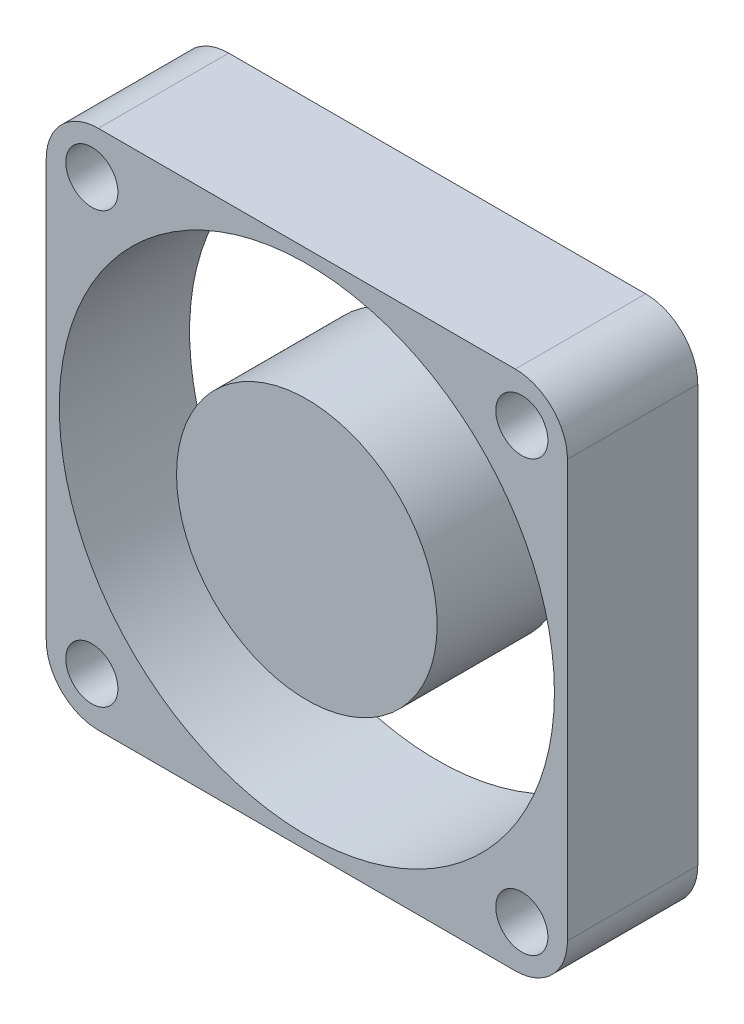
ISO-10303-21;
HEADER;
FILE_DESCRIPTION(('STEP AP214'),'2;1');
FILE_NAME('part.step','',(''),(''),'','','');
FILE_SCHEMA(('AUTOMOTIVE_DESIGN { 1 0 10303 214 1 1 1 1 }'));
ENDSEC;
DATA;
#1=APPLICATION_CONTEXT('core data for automotive mechanical design processes');
#2=APPLICATION_PROTOCOL_DEFINITION('international standard','automotive_design',2000,#1);
#3=PRODUCT_CONTEXT('',#1,'mechanical');
#4=PRODUCT('Part','Part','',(#3));
#5=PRODUCT_RELATED_PRODUCT_CATEGORY('part','',(#4));
#6=PRODUCT_DEFINITION_FORMATION('','',#4);
#7=PRODUCT_DEFINITION_CONTEXT('part definition',#1,'design');
#8=PRODUCT_DEFINITION('design','',#6,#7);
#9=PRODUCT_DEFINITION_SHAPE('','',#8);
#10=(LENGTH_UNIT() NAMED_UNIT(*) SI_UNIT(.MILLI.,.METRE.));
#11=(NAMED_UNIT(*) PLANE_ANGLE_UNIT() SI_UNIT($,.RADIAN.));
#12=(NAMED_UNIT(*) SI_UNIT($,.STERADIAN.) SOLID_ANGLE_UNIT());
#13=UNCERTAINTY_MEASURE_WITH_UNIT(LENGTH_MEASURE(1.E-05),#10,'distance_accuracy_value','');
#14=(GEOMETRIC_REPRESENTATION_CONTEXT(3) GLOBAL_UNCERTAINTY_ASSIGNED_CONTEXT((#13)) GLOBAL_UNIT_ASSIGNED_CONTEXT((#10,
#11,#12)) REPRESENTATION_CONTEXT('',''));
#15=CARTESIAN_POINT('',(0.,0.,0.));
#16=DIRECTION('',(0.,0.,1.));
#17=DIRECTION('',(1.,0.,0.));
#18=AXIS2_PLACEMENT_3D('',#15,#16,#17);
#19=CARTESIAN_POINT('',(20.,20.,10.));
#20=DIRECTION('',(0.,0.,-1.));
#21=DIRECTION('',(-1.,0.,0.));
#22=AXIS2_PLACEMENT_3D('',#19,#20,#21);
#23=CYLINDRICAL_SURFACE('',#22,10.);
#24=CARTESIAN_POINT('',(20.,20.,10.));
#25=DIRECTION('',(0.,0.,1.));
#26=DIRECTION('',(1.,0.,0.));
#27=AXIS2_PLACEMENT_3D('',#24,#25,#26);
#28=CIRCLE('',#27,10.);
#29=CARTESIAN_POINT('',(30.,20.,10.));
#30=VERTEX_POINT('',#29);
#31=EDGE_CURVE('E12',#30,#30,#28,.T.);
#32=ORIENTED_EDGE('',*,*,#31,.F.);
#33=EDGE_LOOP('',(#32));
#34=FACE_BOUND('',#33,.T.);
#35=CARTESIAN_POINT('',(20.,20.,0.));
#36=DIRECTION('',(0.,0.,1.));
#37=DIRECTION('',(1.,0.,0.));
#38=AXIS2_PLACEMENT_3D('',#35,#36,#37);
#39=CIRCLE('',#38,10.);
#40=CARTESIAN_POINT('',(30.,20.,0.));
#41=VERTEX_POINT('',#40);
#42=EDGE_CURVE('E60',#41,#41,#39,.T.);
#43=ORIENTED_EDGE('',*,*,#42,.T.);
#44=EDGE_LOOP('',(#43));
#45=FACE_BOUND('',#44,.T.);
#46=ADVANCED_FACE('F57',(#34,#45),#23,.T.);
#47=CARTESIAN_POINT('',(20.,-24.1414213562373,10.));
#48=DIRECTION('',(0.,0.,1.));
#49=DIRECTION('',(1.,0.,0.));
#50=AXIS2_PLACEMENT_3D('',#47,#48,#49);
#51=PLANE('',#50);
#52=ORIENTED_EDGE('',*,*,#31,.T.);
#53=EDGE_LOOP('',(#52));
#54=FACE_BOUND('',#53,.T.);
#55=ADVANCED_FACE('F72',(#54),#51,.T.);
#56=CARTESIAN_POINT('',(20.,-24.1414213562373,0.));
#57=DIRECTION('',(0.,0.,1.));
#58=DIRECTION('',(1.,0.,0.));
#59=AXIS2_PLACEMENT_3D('',#56,#57,#58);
#60=PLANE('',#59);
#61=ORIENTED_EDGE('',*,*,#42,.F.);
#62=EDGE_LOOP('',(#61));
#63=FACE_BOUND('',#62,.T.);
#64=ADVANCED_FACE('F70',(#63),#60,.F.);
#65=CLOSED_SHELL('',(#46,#55,#64));
#66=MANIFOLD_SOLID_BREP('B2',#65);
#67=CARTESIAN_POINT('',(20.,0.,10.));
#68=DIRECTION('',(0.,1.,0.));
#69=DIRECTION('',(0.,0.,1.));
#70=AXIS2_PLACEMENT_3D('',#67,#68,#69);
#71=PLANE('',#70);
#72=DIRECTION('',(1.,0.,0.));
#73=VECTOR('',#72,1.);
#74=CARTESIAN_POINT('',(20.,0.,10.));
#75=LINE('',#74,#73);
#76=CARTESIAN_POINT('',(4.,0.,10.));
#77=VERTEX_POINT('',#76);
#78=CARTESIAN_POINT('',(36.,0.,10.));
#79=VERTEX_POINT('',#78);
#80=EDGE_CURVE('E220',#77,#79,#75,.T.);
#81=ORIENTED_EDGE('',*,*,#80,.F.);
#82=DIRECTION('',(0.,0.,-1.));
#83=VECTOR('',#82,1.);
#84=CARTESIAN_POINT('',(4.,0.,0.));
#85=LINE('',#84,#83);
#86=CARTESIAN_POINT('',(4.,0.,0.));
#87=VERTEX_POINT('',#86);
#88=EDGE_CURVE('E216',#77,#87,#85,.T.);
#89=ORIENTED_EDGE('',*,*,#88,.T.);
#90=DIRECTION('',(1.,0.,0.));
#91=VECTOR('',#90,1.);
#92=CARTESIAN_POINT('',(20.,0.,0.));
#93=LINE('',#92,#91);
#94=CARTESIAN_POINT('',(36.,0.,0.));
#95=VERTEX_POINT('',#94);
#96=EDGE_CURVE('E170',#87,#95,#93,.T.);
#97=ORIENTED_EDGE('',*,*,#96,.T.);
#98=DIRECTION('',(0.,0.,-1.));
#99=VECTOR('',#98,1.);
#100=CARTESIAN_POINT('',(36.,0.,10.));
#101=LINE('',#100,#99);
#102=EDGE_CURVE('E214',#95,#79,#101,.F.);
#103=ORIENTED_EDGE('',*,*,#102,.T.);
#104=EDGE_LOOP('',(#81,#89,#97,#103));
#105=FACE_BOUND('',#104,.T.);
#106=ADVANCED_FACE('F99',(#105),#71,.F.);
#107=CARTESIAN_POINT('',(40.,-24.1414213562373,10.));
#108=DIRECTION('',(-1.,0.,0.));
#109=DIRECTION('',(0.,-1.,0.));
#110=AXIS2_PLACEMENT_3D('',#107,#108,#109);
#111=PLANE('',#110);
#112=DIRECTION('',(0.,1.,0.));
#113=VECTOR('',#112,1.);
#114=CARTESIAN_POINT('',(40.,-24.1414213562373,10.));
#115=LINE('',#114,#113);
#116=CARTESIAN_POINT('',(40.,4.,10.));
#117=VERTEX_POINT('',#116);
#118=CARTESIAN_POINT('',(40.,36.,10.));
#119=VERTEX_POINT('',#118);
#120=EDGE_CURVE('E221',#117,#119,#115,.T.);
#121=ORIENTED_EDGE('',*,*,#120,.F.);
#122=DIRECTION('',(0.,0.,-1.));
#123=VECTOR('',#122,1.);
#124=CARTESIAN_POINT('',(40.,4.,10.));
#125=LINE('',#124,#123);
#126=CARTESIAN_POINT('',(40.,4.,0.));
#127=VERTEX_POINT('',#126);
#128=EDGE_CURVE('E55',#117,#127,#125,.T.);
#129=ORIENTED_EDGE('',*,*,#128,.T.);
#130=DIRECTION('',(0.,1.,0.));
#131=VECTOR('',#130,1.);
#132=CARTESIAN_POINT('',(40.,-24.1414213562373,0.));
#133=LINE('',#132,#131);
#134=CARTESIAN_POINT('',(40.,36.,0.));
#135=VERTEX_POINT('',#134);
#136=EDGE_CURVE('E248',#127,#135,#133,.T.);
#137=ORIENTED_EDGE('',*,*,#136,.T.);
#138=DIRECTION('',(0.,0.,-1.));
#139=VECTOR('',#138,1.);
#140=CARTESIAN_POINT('',(40.,36.,10.));
#141=LINE('',#140,#139);
#142=EDGE_CURVE('E107',#135,#119,#141,.F.);
#143=ORIENTED_EDGE('',*,*,#142,.T.);
#144=EDGE_LOOP('',(#121,#129,#137,#143));
#145=FACE_BOUND('',#144,.T.);
#146=ADVANCED_FACE('F270',(#145),#111,.F.);
#147=CARTESIAN_POINT('',(20.,40.,10.));
#148=DIRECTION('',(0.,1.,0.));
#149=DIRECTION('',(0.,0.,1.));
#150=AXIS2_PLACEMENT_3D('',#147,#148,#149);
#151=PLANE('',#150);
#152=DIRECTION('',(1.,0.,0.));
#153=VECTOR('',#152,1.);
#154=CARTESIAN_POINT('',(20.,40.,0.));
#155=LINE('',#154,#153);
#156=CARTESIAN_POINT('',(4.,40.,0.));
#157=VERTEX_POINT('',#156);
#158=CARTESIAN_POINT('',(36.,40.,0.));
#159=VERTEX_POINT('',#158);
#160=EDGE_CURVE('E187',#157,#159,#155,.T.);
#161=ORIENTED_EDGE('',*,*,#160,.F.);
#162=DIRECTION('',(0.,0.,-1.));
#163=VECTOR('',#162,1.);
#164=CARTESIAN_POINT('',(4.,40.,10.));
#165=LINE('',#164,#163);
#166=CARTESIAN_POINT('',(4.,40.,10.));
#167=VERTEX_POINT('',#166);
#168=EDGE_CURVE('E206',#157,#167,#165,.F.);
#169=ORIENTED_EDGE('',*,*,#168,.T.);
#170=DIRECTION('',(1.,0.,0.));
#171=VECTOR('',#170,1.);
#172=CARTESIAN_POINT('',(20.,40.,10.));
#173=LINE('',#172,#171);
#174=CARTESIAN_POINT('',(36.,40.,10.));
#175=VERTEX_POINT('',#174);
#176=EDGE_CURVE('E196',#167,#175,#173,.T.);
#177=ORIENTED_EDGE('',*,*,#176,.T.);
#178=DIRECTION('',(0.,0.,-1.));
#179=VECTOR('',#178,1.);
#180=CARTESIAN_POINT('',(36.,40.,0.));
#181=LINE('',#180,#179);
#182=EDGE_CURVE('E203',#175,#159,#181,.T.);
#183=ORIENTED_EDGE('',*,*,#182,.T.);
#184=EDGE_LOOP('',(#161,#169,#177,#183));
#185=FACE_BOUND('',#184,.T.);
#186=ADVANCED_FACE('F254',(#185),#151,.T.);
#187=CARTESIAN_POINT('',(20.,20.,10.));
#188=DIRECTION('',(0.,0.,-1.));
#189=DIRECTION('',(-1.,0.,0.));
#190=AXIS2_PLACEMENT_3D('',#187,#188,#189);
#191=CYLINDRICAL_SURFACE('',#190,19.);
#192=CARTESIAN_POINT('',(20.,20.,10.));
#193=DIRECTION('',(0.,0.,1.));
#194=DIRECTION('',(1.,0.,0.));
#195=AXIS2_PLACEMENT_3D('',#192,#193,#194);
#196=CIRCLE('',#195,19.);
#197=CARTESIAN_POINT('',(39.,20.,10.));
#198=VERTEX_POINT('',#197);
#199=EDGE_CURVE('E222',#198,#198,#196,.T.);
#200=ORIENTED_EDGE('',*,*,#199,.T.);
#201=EDGE_LOOP('',(#200));
#202=FACE_BOUND('',#201,.T.);
#203=CARTESIAN_POINT('',(20.,20.,0.));
#204=DIRECTION('',(0.,0.,1.));
#205=DIRECTION('',(1.,0.,0.));
#206=AXIS2_PLACEMENT_3D('',#203,#204,#205);
#207=CIRCLE('',#206,19.);
#208=CARTESIAN_POINT('',(39.,20.,0.));
#209=VERTEX_POINT('',#208);
#210=EDGE_CURVE('E244',#209,#209,#207,.T.);
#211=ORIENTED_EDGE('',*,*,#210,.F.);
#212=EDGE_LOOP('',(#211));
#213=FACE_BOUND('',#212,.T.);
#214=ADVANCED_FACE('F278',(#202,#213),#191,.F.);
#215=CARTESIAN_POINT('',(36.5,36.5,10.));
#216=DIRECTION('',(0.,0.,-1.));
#217=DIRECTION('',(-1.,0.,0.));
#218=AXIS2_PLACEMENT_3D('',#215,#216,#217);
#219=CYLINDRICAL_SURFACE('',#218,2.);
#220=CARTESIAN_POINT('',(36.5,36.5,10.));
#221=DIRECTION('',(0.,0.,1.));
#222=DIRECTION('',(1.,0.,0.));
#223=AXIS2_PLACEMENT_3D('',#220,#221,#222);
#224=CIRCLE('',#223,2.);
#225=CARTESIAN_POINT('',(38.5,36.5,10.));
#226=VERTEX_POINT('',#225);
#227=EDGE_CURVE('E226',#226,#226,#224,.T.);
#228=ORIENTED_EDGE('',*,*,#227,.T.);
#229=EDGE_LOOP('',(#228));
#230=FACE_BOUND('',#229,.T.);
#231=CARTESIAN_POINT('',(36.5,36.5,0.));
#232=DIRECTION('',(0.,0.,1.));
#233=DIRECTION('',(1.,0.,0.));
#234=AXIS2_PLACEMENT_3D('',#231,#232,#233);
#235=CIRCLE('',#234,2.);
#236=CARTESIAN_POINT('',(38.5,36.5,0.));
#237=VERTEX_POINT('',#236);
#238=EDGE_CURVE('E241',#237,#237,#235,.T.);
#239=ORIENTED_EDGE('',*,*,#238,.F.);
#240=EDGE_LOOP('',(#239));
#241=FACE_BOUND('',#240,.T.);
#242=ADVANCED_FACE('F281',(#230,#241),#219,.F.);
#243=CARTESIAN_POINT('',(36.5,3.5,10.));
#244=DIRECTION('',(0.,0.,-1.));
#245=DIRECTION('',(-1.,0.,0.));
#246=AXIS2_PLACEMENT_3D('',#243,#244,#245);
#247=CYLINDRICAL_SURFACE('',#246,2.);
#248=CARTESIAN_POINT('',(36.5,3.5,10.));
#249=DIRECTION('',(0.,0.,1.));
#250=DIRECTION('',(1.,0.,0.));
#251=AXIS2_PLACEMENT_3D('',#248,#249,#250);
#252=CIRCLE('',#251,2.);
#253=CARTESIAN_POINT('',(38.5,3.5,10.));
#254=VERTEX_POINT('',#253);
#255=EDGE_CURVE('E406',#254,#254,#252,.T.);
#256=ORIENTED_EDGE('',*,*,#255,.T.);
#257=EDGE_LOOP('',(#256));
#258=FACE_BOUND('',#257,.T.);
#259=CARTESIAN_POINT('',(36.5,3.5,0.));
#260=DIRECTION('',(0.,0.,1.));
#261=DIRECTION('',(1.,0.,0.));
#262=AXIS2_PLACEMENT_3D('',#259,#260,#261);
#263=CIRCLE('',#262,2.);
#264=CARTESIAN_POINT('',(38.5,3.5,0.));
#265=VERTEX_POINT('',#264);
#266=EDGE_CURVE('E238',#265,#265,#263,.T.);
#267=ORIENTED_EDGE('',*,*,#266,.F.);
#268=EDGE_LOOP('',(#267));
#269=FACE_BOUND('',#268,.T.);
#270=ADVANCED_FACE('F285',(#258,#269),#247,.F.);
#271=CARTESIAN_POINT('',(3.5,3.5,10.));
#272=DIRECTION('',(0.,0.,-1.));
#273=DIRECTION('',(-1.,0.,0.));
#274=AXIS2_PLACEMENT_3D('',#271,#272,#273);
#275=CYLINDRICAL_SURFACE('',#274,2.);
#276=CARTESIAN_POINT('',(3.5,3.5,10.));
#277=DIRECTION('',(0.,0.,1.));
#278=DIRECTION('',(1.,0.,0.));
#279=AXIS2_PLACEMENT_3D('',#276,#277,#278);
#280=CIRCLE('',#279,2.);
#281=CARTESIAN_POINT('',(5.5,3.5,10.));
#282=VERTEX_POINT('',#281);
#283=EDGE_CURVE('E402',#282,#282,#280,.T.);
#284=ORIENTED_EDGE('',*,*,#283,.T.);
#285=EDGE_LOOP('',(#284));
#286=FACE_BOUND('',#285,.T.);
#287=CARTESIAN_POINT('',(3.5,3.5,0.));
#288=DIRECTION('',(0.,0.,1.));
#289=DIRECTION('',(1.,0.,0.));
#290=AXIS2_PLACEMENT_3D('',#287,#288,#289);
#291=CIRCLE('',#290,2.);
#292=CARTESIAN_POINT('',(5.5,3.5,0.));
#293=VERTEX_POINT('',#292);
#294=EDGE_CURVE('E235',#293,#293,#291,.T.);
#295=ORIENTED_EDGE('',*,*,#294,.F.);
#296=EDGE_LOOP('',(#295));
#297=FACE_BOUND('',#296,.T.);
#298=ADVANCED_FACE('F289',(#286,#297),#275,.F.);
#299=CARTESIAN_POINT('',(3.5,36.5,10.));
#300=DIRECTION('',(0.,0.,-1.));
#301=DIRECTION('',(-1.,0.,0.));
#302=AXIS2_PLACEMENT_3D('',#299,#300,#301);
#303=CYLINDRICAL_SURFACE('',#302,2.);
#304=CARTESIAN_POINT('',(3.5,36.5,10.));
#305=DIRECTION('',(0.,0.,1.));
#306=DIRECTION('',(1.,0.,0.));
#307=AXIS2_PLACEMENT_3D('',#304,#305,#306);
#308=CIRCLE('',#307,2.);
#309=CARTESIAN_POINT('',(5.5,36.5,10.));
#310=VERTEX_POINT('',#309);
#311=EDGE_CURVE('E186',#310,#310,#308,.T.);
#312=ORIENTED_EDGE('',*,*,#311,.T.);
#313=EDGE_LOOP('',(#312));
#314=FACE_BOUND('',#313,.T.);
#315=CARTESIAN_POINT('',(3.5,36.5,0.));
#316=DIRECTION('',(0.,0.,1.));
#317=DIRECTION('',(1.,0.,0.));
#318=AXIS2_PLACEMENT_3D('',#315,#316,#317);
#319=CIRCLE('',#318,2.);
#320=CARTESIAN_POINT('',(5.5,36.5,0.));
#321=VERTEX_POINT('',#320);
#322=EDGE_CURVE('E232',#321,#321,#319,.T.);
#323=ORIENTED_EDGE('',*,*,#322,.F.);
#324=EDGE_LOOP('',(#323));
#325=FACE_BOUND('',#324,.T.);
#326=ADVANCED_FACE('F293',(#314,#325),#303,.F.);
#327=CARTESIAN_POINT('',(0.,-24.1414213562373,10.));
#328=DIRECTION('',(-1.,0.,0.));
#329=DIRECTION('',(0.,0.,1.));
#330=AXIS2_PLACEMENT_3D('',#327,#328,#329);
#331=PLANE('',#330);
#332=DIRECTION('',(0.,1.,0.));
#333=VECTOR('',#332,1.);
#334=CARTESIAN_POINT('',(0.,-24.1414213562373,10.));
#335=LINE('',#334,#333);
#336=CARTESIAN_POINT('',(0.,4.,10.));
#337=VERTEX_POINT('',#336);
#338=CARTESIAN_POINT('',(0.,36.,10.));
#339=VERTEX_POINT('',#338);
#340=EDGE_CURVE('E192',#337,#339,#335,.T.);
#341=ORIENTED_EDGE('',*,*,#340,.T.);
#342=DIRECTION('',(0.,0.,-1.));
#343=VECTOR('',#342,1.);
#344=CARTESIAN_POINT('',(0.,36.,10.));
#345=LINE('',#344,#343);
#346=CARTESIAN_POINT('',(0.,36.,0.));
#347=VERTEX_POINT('',#346);
#348=EDGE_CURVE('E185',#339,#347,#345,.T.);
#349=ORIENTED_EDGE('',*,*,#348,.T.);
#350=DIRECTION('',(0.,1.,0.));
#351=VECTOR('',#350,1.);
#352=CARTESIAN_POINT('',(0.,-24.1414213562373,0.));
#353=LINE('',#352,#351);
#354=CARTESIAN_POINT('',(0.,4.,0.));
#355=VERTEX_POINT('',#354);
#356=EDGE_CURVE('E168',#355,#347,#353,.T.);
#357=ORIENTED_EDGE('',*,*,#356,.F.);
#358=DIRECTION('',(0.,0.,-1.));
#359=VECTOR('',#358,1.);
#360=CARTESIAN_POINT('',(0.,4.,10.));
#361=LINE('',#360,#359);
#362=EDGE_CURVE('E182',#355,#337,#361,.F.);
#363=ORIENTED_EDGE('',*,*,#362,.T.);
#364=EDGE_LOOP('',(#341,#349,#357,#363));
#365=FACE_BOUND('',#364,.T.);
#366=ADVANCED_FACE('F181',(#365),#331,.T.);
#367=CARTESIAN_POINT('',(20.,-24.1414213562373,10.));
#368=DIRECTION('',(0.,0.,1.));
#369=DIRECTION('',(1.,0.,0.));
#370=AXIS2_PLACEMENT_3D('',#367,#368,#369);
#371=PLANE('',#370);
#372=ORIENTED_EDGE('',*,*,#311,.F.);
#373=EDGE_LOOP('',(#372));
#374=FACE_BOUND('',#373,.T.);
#375=ORIENTED_EDGE('',*,*,#283,.F.);
#376=EDGE_LOOP('',(#375));
#377=FACE_BOUND('',#376,.T.);
#378=ORIENTED_EDGE('',*,*,#255,.F.);
#379=EDGE_LOOP('',(#378));
#380=FACE_BOUND('',#379,.T.);
#381=ORIENTED_EDGE('',*,*,#227,.F.);
#382=EDGE_LOOP('',(#381));
#383=FACE_BOUND('',#382,.T.);
#384=ORIENTED_EDGE('',*,*,#199,.F.);
#385=EDGE_LOOP('',(#384));
#386=FACE_BOUND('',#385,.T.);
#387=ORIENTED_EDGE('',*,*,#176,.F.);
#388=CARTESIAN_POINT('',(4.,36.,10.));
#389=DIRECTION('',(0.,0.,1.));
#390=DIRECTION('',(1.,0.,0.));
#391=AXIS2_PLACEMENT_3D('',#388,#389,#390);
#392=CIRCLE('',#391,4.);
#393=EDGE_CURVE('E212',#167,#339,#392,.T.);
#394=ORIENTED_EDGE('',*,*,#393,.T.);
#395=ORIENTED_EDGE('',*,*,#340,.F.);
#396=CARTESIAN_POINT('',(4.,4.,10.));
#397=DIRECTION('',(0.,0.,1.));
#398=DIRECTION('',(1.,0.,0.));
#399=AXIS2_PLACEMENT_3D('',#396,#397,#398);
#400=CIRCLE('',#399,4.);
#401=EDGE_CURVE('E191',#337,#77,#400,.T.);
#402=ORIENTED_EDGE('',*,*,#401,.T.);
#403=ORIENTED_EDGE('',*,*,#80,.T.);
#404=CARTESIAN_POINT('',(36.,4.,10.));
#405=DIRECTION('',(0.,0.,1.));
#406=DIRECTION('',(1.,0.,0.));
#407=AXIS2_PLACEMENT_3D('',#404,#405,#406);
#408=CIRCLE('',#407,4.);
#409=EDGE_CURVE('E120',#79,#117,#408,.T.);
#410=ORIENTED_EDGE('',*,*,#409,.T.);
#411=ORIENTED_EDGE('',*,*,#120,.T.);
#412=CARTESIAN_POINT('',(36.,36.,10.));
#413=DIRECTION('',(0.,0.,1.));
#414=DIRECTION('',(1.,0.,0.));
#415=AXIS2_PLACEMENT_3D('',#412,#413,#414);
#416=CIRCLE('',#415,4.);
#417=EDGE_CURVE('E208',#119,#175,#416,.T.);
#418=ORIENTED_EDGE('',*,*,#417,.T.);
#419=EDGE_LOOP('',(#387,#394,#395,#402,#403,#410,#411,#418));
#420=FACE_BOUND('',#419,.T.);
#421=ADVANCED_FACE('F260',(#374,#377,#380,#383,#386,#420),#371,.T.);
#422=CARTESIAN_POINT('',(20.,-24.1414213562373,0.));
#423=DIRECTION('',(0.,0.,1.));
#424=DIRECTION('',(1.,0.,0.));
#425=AXIS2_PLACEMENT_3D('',#422,#423,#424);
#426=PLANE('',#425);
#427=ORIENTED_EDGE('',*,*,#322,.T.);
#428=EDGE_LOOP('',(#427));
#429=FACE_BOUND('',#428,.T.);
#430=ORIENTED_EDGE('',*,*,#294,.T.);
#431=EDGE_LOOP('',(#430));
#432=FACE_BOUND('',#431,.T.);
#433=ORIENTED_EDGE('',*,*,#266,.T.);
#434=EDGE_LOOP('',(#433));
#435=FACE_BOUND('',#434,.T.);
#436=ORIENTED_EDGE('',*,*,#238,.T.);
#437=EDGE_LOOP('',(#436));
#438=FACE_BOUND('',#437,.T.);
#439=ORIENTED_EDGE('',*,*,#210,.T.);
#440=EDGE_LOOP('',(#439));
#441=FACE_BOUND('',#440,.T.);
#442=ORIENTED_EDGE('',*,*,#356,.T.);
#443=CARTESIAN_POINT('',(4.,36.,0.));
#444=DIRECTION('',(0.,0.,1.));
#445=DIRECTION('',(1.,0.,0.));
#446=AXIS2_PLACEMENT_3D('',#443,#444,#445);
#447=CIRCLE('',#446,4.);
#448=EDGE_CURVE('E175',#347,#157,#447,.F.);
#449=ORIENTED_EDGE('',*,*,#448,.T.);
#450=ORIENTED_EDGE('',*,*,#160,.T.);
#451=CARTESIAN_POINT('',(36.,36.,0.));
#452=DIRECTION('',(0.,0.,1.));
#453=DIRECTION('',(1.,0.,0.));
#454=AXIS2_PLACEMENT_3D('',#451,#452,#453);
#455=CIRCLE('',#454,4.);
#456=EDGE_CURVE('E194',#159,#135,#455,.F.);
#457=ORIENTED_EDGE('',*,*,#456,.T.);
#458=ORIENTED_EDGE('',*,*,#136,.F.);
#459=CARTESIAN_POINT('',(36.,4.,0.));
#460=DIRECTION('',(0.,0.,1.));
#461=DIRECTION('',(1.,0.,0.));
#462=AXIS2_PLACEMENT_3D('',#459,#460,#461);
#463=CIRCLE('',#462,4.);
#464=EDGE_CURVE('E176',#127,#95,#463,.F.);
#465=ORIENTED_EDGE('',*,*,#464,.T.);
#466=ORIENTED_EDGE('',*,*,#96,.F.);
#467=CARTESIAN_POINT('',(4.,4.,0.));
#468=DIRECTION('',(0.,0.,1.));
#469=DIRECTION('',(1.,0.,0.));
#470=AXIS2_PLACEMENT_3D('',#467,#468,#469);
#471=CIRCLE('',#470,4.);
#472=EDGE_CURVE('E165',#87,#355,#471,.F.);
#473=ORIENTED_EDGE('',*,*,#472,.T.);
#474=EDGE_LOOP('',(#442,#449,#450,#457,#458,#465,#466,#473));
#475=FACE_BOUND('',#474,.T.);
#476=ADVANCED_FACE('F167',(#429,#432,#435,#438,#441,#475),#426,.F.);
#477=CARTESIAN_POINT('',(4.,36.,10.));
#478=DIRECTION('',(0.,0.,-1.));
#479=DIRECTION('',(-1.,0.,0.));
#480=AXIS2_PLACEMENT_3D('',#477,#478,#479);
#481=CYLINDRICAL_SURFACE('',#480,4.);
#482=ORIENTED_EDGE('',*,*,#393,.F.);
#483=ORIENTED_EDGE('',*,*,#168,.F.);
#484=ORIENTED_EDGE('',*,*,#448,.F.);
#485=ORIENTED_EDGE('',*,*,#348,.F.);
#486=EDGE_LOOP('',(#482,#483,#484,#485));
#487=FACE_BOUND('',#486,.T.);
#488=ADVANCED_FACE('F259',(#487),#481,.T.);
#489=CARTESIAN_POINT('',(4.,4.,10.));
#490=DIRECTION('',(0.,0.,1.));
#491=DIRECTION('',(1.,0.,0.));
#492=AXIS2_PLACEMENT_3D('',#489,#490,#491);
#493=CYLINDRICAL_SURFACE('',#492,4.);
#494=ORIENTED_EDGE('',*,*,#401,.F.);
#495=ORIENTED_EDGE('',*,*,#362,.F.);
#496=ORIENTED_EDGE('',*,*,#472,.F.);
#497=ORIENTED_EDGE('',*,*,#88,.F.);
#498=EDGE_LOOP('',(#494,#495,#496,#497));
#499=FACE_BOUND('',#498,.T.);
#500=ADVANCED_FACE('F190',(#499),#493,.T.);
#501=CARTESIAN_POINT('',(36.,4.,10.));
#502=DIRECTION('',(0.,0.,-1.));
#503=DIRECTION('',(-1.,0.,0.));
#504=AXIS2_PLACEMENT_3D('',#501,#502,#503);
#505=CYLINDRICAL_SURFACE('',#504,4.);
#506=ORIENTED_EDGE('',*,*,#409,.F.);
#507=ORIENTED_EDGE('',*,*,#102,.F.);
#508=ORIENTED_EDGE('',*,*,#464,.F.);
#509=ORIENTED_EDGE('',*,*,#128,.F.);
#510=EDGE_LOOP('',(#506,#507,#508,#509));
#511=FACE_BOUND('',#510,.T.);
#512=ADVANCED_FACE('F264',(#511),#505,.T.);
#513=CARTESIAN_POINT('',(36.,36.,10.));
#514=DIRECTION('',(0.,0.,1.));
#515=DIRECTION('',(1.,0.,0.));
#516=AXIS2_PLACEMENT_3D('',#513,#514,#515);
#517=CYLINDRICAL_SURFACE('',#516,4.);
#518=ORIENTED_EDGE('',*,*,#417,.F.);
#519=ORIENTED_EDGE('',*,*,#142,.F.);
#520=ORIENTED_EDGE('',*,*,#456,.F.);
#521=ORIENTED_EDGE('',*,*,#182,.F.);
#522=EDGE_LOOP('',(#518,#519,#520,#521));
#523=FACE_BOUND('',#522,.T.);
#524=ADVANCED_FACE('F101',(#523),#517,.T.);
#525=CLOSED_SHELL('',(#106,#146,#186,#214,#242,#270,#298,#326,#366,#421,#476,#488,#500,#512,#524));
#526=MANIFOLD_SOLID_BREP('B7',#525);
#527=ADVANCED_BREP_SHAPE_REPRESENTATION('',(#18,#66,#526),#14);
#528=SHAPE_DEFINITION_REPRESENTATION(#9,#527);
ENDSEC;
END-ISO-10303-21;
